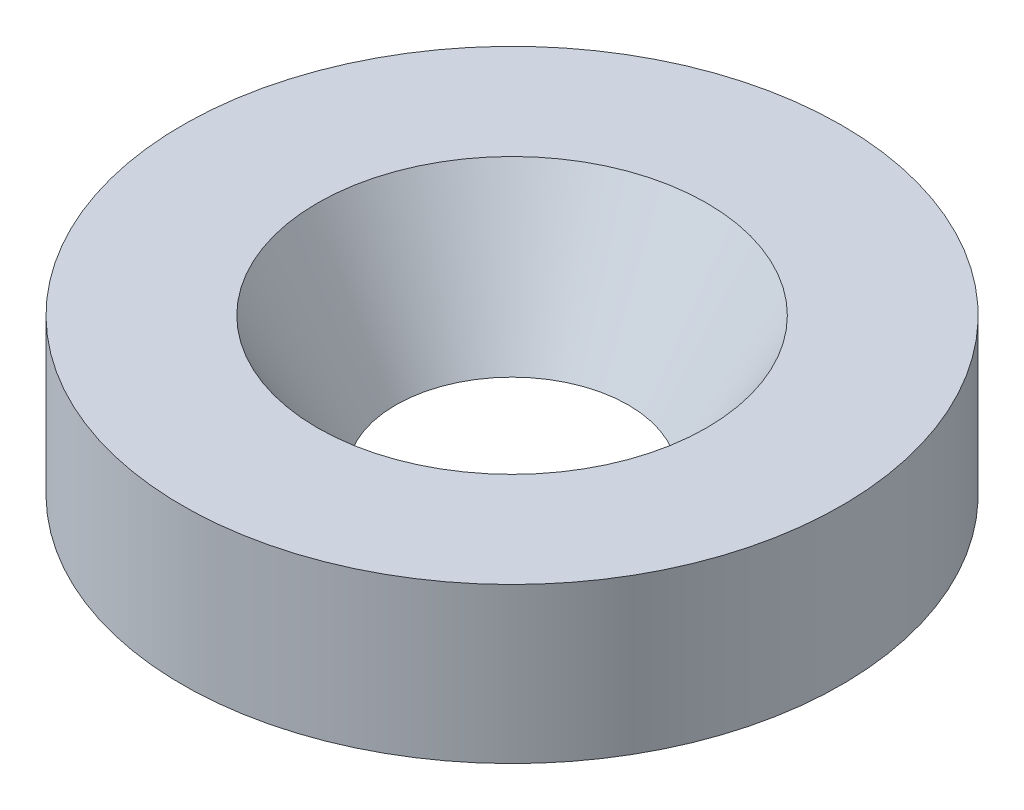
ISO-10303-21;
HEADER;
FILE_DESCRIPTION(('STEP AP214'),'2;1');
FILE_NAME('part.step','',(''),(''),'','','');
FILE_SCHEMA(('AUTOMOTIVE_DESIGN { 1 0 10303 214 1 1 1 1 }'));
ENDSEC;
DATA;
#1=APPLICATION_CONTEXT('core data for automotive mechanical design processes');
#2=APPLICATION_PROTOCOL_DEFINITION('international standard','automotive_design',2000,#1);
#3=PRODUCT_CONTEXT('',#1,'mechanical');
#4=PRODUCT('Part','Part','',(#3));
#5=PRODUCT_RELATED_PRODUCT_CATEGORY('part','',(#4));
#6=PRODUCT_DEFINITION_FORMATION('','',#4);
#7=PRODUCT_DEFINITION_CONTEXT('part definition',#1,'design');
#8=PRODUCT_DEFINITION('design','',#6,#7);
#9=PRODUCT_DEFINITION_SHAPE('','',#8);
#10=(LENGTH_UNIT() NAMED_UNIT(*) SI_UNIT(.MILLI.,.METRE.));
#11=(NAMED_UNIT(*) PLANE_ANGLE_UNIT() SI_UNIT($,.RADIAN.));
#12=(NAMED_UNIT(*) SI_UNIT($,.STERADIAN.) SOLID_ANGLE_UNIT());
#13=UNCERTAINTY_MEASURE_WITH_UNIT(LENGTH_MEASURE(1.E-05),#10,'distance_accuracy_value','');
#14=(GEOMETRIC_REPRESENTATION_CONTEXT(3) GLOBAL_UNCERTAINTY_ASSIGNED_CONTEXT((#13)) GLOBAL_UNIT_ASSIGNED_CONTEXT((#10,
#11,#12)) REPRESENTATION_CONTEXT('',''));
#15=CARTESIAN_POINT('',(0.,0.,0.));
#16=DIRECTION('',(0.,0.,1.));
#17=DIRECTION('',(1.,0.,0.));
#18=AXIS2_PLACEMENT_3D('',#15,#16,#17);
#19=CARTESIAN_POINT('',(0.,0.,0.));
#20=DIRECTION('',(0.,-1.,0.));
#21=DIRECTION('',(0.,0.,-1.));
#22=AXIS2_PLACEMENT_3D('',#19,#20,#21);
#23=CYLINDRICAL_SURFACE('',#22,8.);
#24=CARTESIAN_POINT('',(0.,0.,0.));
#25=DIRECTION('',(0.,-1.,0.));
#26=DIRECTION('',(0.,0.,-1.));
#27=AXIS2_PLACEMENT_3D('',#24,#25,#26);
#28=CIRCLE('',#27,8.);
#29=CARTESIAN_POINT('',(0.,0.,-8.));
#30=VERTEX_POINT('',#29);
#31=EDGE_CURVE('E10',#30,#30,#28,.T.);
#32=ORIENTED_EDGE('',*,*,#31,.T.);
#33=EDGE_LOOP('',(#32));
#34=FACE_BOUND('',#33,.T.);
#35=CARTESIAN_POINT('',(0.,2.75,0.));
#36=DIRECTION('',(0.,-1.,0.));
#37=DIRECTION('',(0.,0.,-1.));
#38=AXIS2_PLACEMENT_3D('',#35,#36,#37);
#39=CIRCLE('',#38,8.);
#40=CARTESIAN_POINT('',(0.,2.75,-8.));
#41=VERTEX_POINT('',#40);
#42=EDGE_CURVE('E76',#41,#41,#39,.T.);
#43=ORIENTED_EDGE('',*,*,#42,.F.);
#44=EDGE_LOOP('',(#43));
#45=FACE_BOUND('',#44,.T.);
#46=ADVANCED_FACE('F41',(#34,#45),#23,.F.);
#47=CARTESIAN_POINT('',(0.,0.,-8.));
#48=DIRECTION('',(0.,-1.,0.));
#49=DIRECTION('',(0.,0.,-1.));
#50=AXIS2_PLACEMENT_3D('',#47,#48,#49);
#51=PLANE('',#50);
#52=CARTESIAN_POINT('',(0.,0.,0.));
#53=DIRECTION('',(0.,-1.,0.));
#54=DIRECTION('',(0.,0.,-1.));
#55=AXIS2_PLACEMENT_3D('',#52,#53,#54);
#56=CIRCLE('',#55,8.5);
#57=CARTESIAN_POINT('',(0.,0.,-8.5));
#58=VERTEX_POINT('',#57);
#59=EDGE_CURVE('E48',#58,#58,#56,.T.);
#60=ORIENTED_EDGE('',*,*,#59,.T.);
#61=EDGE_LOOP('',(#60));
#62=FACE_BOUND('',#61,.T.);
#63=ORIENTED_EDGE('',*,*,#31,.F.);
#64=EDGE_LOOP('',(#63));
#65=FACE_BOUND('',#64,.T.);
#66=ADVANCED_FACE('F85',(#62,#65),#51,.T.);
#67=CARTESIAN_POINT('',(0.,0.,0.));
#68=DIRECTION('',(0.,-1.,0.));
#69=DIRECTION('',(0.,0.,-1.));
#70=AXIS2_PLACEMENT_3D('',#67,#68,#69);
#71=CYLINDRICAL_SURFACE('',#70,8.5);
#72=CARTESIAN_POINT('',(0.,4.,0.));
#73=DIRECTION('',(0.,-1.,0.));
#74=DIRECTION('',(0.,0.,-1.));
#75=AXIS2_PLACEMENT_3D('',#72,#73,#74);
#76=CIRCLE('',#75,8.5);
#77=CARTESIAN_POINT('',(0.,4.,-8.5));
#78=VERTEX_POINT('',#77);
#79=EDGE_CURVE('E53',#78,#78,#76,.T.);
#80=ORIENTED_EDGE('',*,*,#79,.T.);
#81=EDGE_LOOP('',(#80));
#82=FACE_BOUND('',#81,.T.);
#83=ORIENTED_EDGE('',*,*,#59,.F.);
#84=EDGE_LOOP('',(#83));
#85=FACE_BOUND('',#84,.T.);
#86=ADVANCED_FACE('F89',(#82,#85),#71,.T.);
#87=CARTESIAN_POINT('',(0.,4.,-8.5));
#88=DIRECTION('',(0.,1.,0.));
#89=DIRECTION('',(0.,0.,1.));
#90=AXIS2_PLACEMENT_3D('',#87,#88,#89);
#91=PLANE('',#90);
#92=CARTESIAN_POINT('',(0.,4.,0.));
#93=DIRECTION('',(0.,-1.,0.));
#94=DIRECTION('',(0.,0.,-1.));
#95=AXIS2_PLACEMENT_3D('',#92,#93,#94);
#96=CIRCLE('',#95,5.02072594216371);
#97=CARTESIAN_POINT('',(0.,4.,-5.02072594216371));
#98=VERTEX_POINT('',#97);
#99=EDGE_CURVE('E58',#98,#98,#96,.T.);
#100=ORIENTED_EDGE('',*,*,#99,.T.);
#101=EDGE_LOOP('',(#100));
#102=FACE_BOUND('',#101,.T.);
#103=ORIENTED_EDGE('',*,*,#79,.F.);
#104=EDGE_LOOP('',(#103));
#105=FACE_BOUND('',#104,.T.);
#106=ADVANCED_FACE('F93',(#102,#105),#91,.T.);
#107=CARTESIAN_POINT('',(0.,4.,0.));
#108=DIRECTION('',(0.,1.,0.));
#109=DIRECTION('',(0.,0.,1.));
#110=AXIS2_PLACEMENT_3D('',#107,#108,#109);
#111=CONICAL_SURFACE('',#110,5.02072594216371,0.523598775598303);
#112=CARTESIAN_POINT('',(0.,0.499999999999999,0.));
#113=DIRECTION('',(0.,-1.,0.));
#114=DIRECTION('',(0.,0.,-1.));
#115=AXIS2_PLACEMENT_3D('',#112,#113,#114);
#116=CIRCLE('',#115,3.);
#117=CARTESIAN_POINT('',(0.,0.499999999999999,-3.));
#118=VERTEX_POINT('',#117);
#119=EDGE_CURVE('E64',#118,#118,#116,.T.);
#120=ORIENTED_EDGE('',*,*,#119,.T.);
#121=EDGE_LOOP('',(#120));
#122=FACE_BOUND('',#121,.T.);
#123=ORIENTED_EDGE('',*,*,#99,.F.);
#124=EDGE_LOOP('',(#123));
#125=FACE_BOUND('',#124,.T.);
#126=ADVANCED_FACE('F100',(#122,#125),#111,.F.);
#127=CARTESIAN_POINT('',(0.,0.499999999999999,-3.));
#128=DIRECTION('',(0.,-1.,0.));
#129=DIRECTION('',(0.,0.,-1.));
#130=AXIS2_PLACEMENT_3D('',#127,#128,#129);
#131=PLANE('',#130);
#132=CARTESIAN_POINT('',(0.,0.499999999999999,0.));
#133=DIRECTION('',(0.,-1.,0.));
#134=DIRECTION('',(0.,0.,-1.));
#135=AXIS2_PLACEMENT_3D('',#132,#133,#134);
#136=CIRCLE('',#135,6.);
#137=CARTESIAN_POINT('',(0.,0.499999999999999,-6.));
#138=VERTEX_POINT('',#137);
#139=EDGE_CURVE('E68',#138,#138,#136,.T.);
#140=ORIENTED_EDGE('',*,*,#139,.T.);
#141=EDGE_LOOP('',(#140));
#142=FACE_BOUND('',#141,.T.);
#143=ORIENTED_EDGE('',*,*,#119,.F.);
#144=EDGE_LOOP('',(#143));
#145=FACE_BOUND('',#144,.T.);
#146=ADVANCED_FACE('F104',(#142,#145),#131,.T.);
#147=CARTESIAN_POINT('',(0.,0.,0.));
#148=DIRECTION('',(0.,-1.,0.));
#149=DIRECTION('',(0.,0.,-1.));
#150=AXIS2_PLACEMENT_3D('',#147,#148,#149);
#151=CYLINDRICAL_SURFACE('',#150,6.);
#152=CARTESIAN_POINT('',(0.,2.75,0.));
#153=DIRECTION('',(0.,-1.,0.));
#154=DIRECTION('',(0.,0.,-1.));
#155=AXIS2_PLACEMENT_3D('',#152,#153,#154);
#156=CIRCLE('',#155,6.);
#157=CARTESIAN_POINT('',(0.,2.75,-6.));
#158=VERTEX_POINT('',#157);
#159=EDGE_CURVE('E72',#158,#158,#156,.T.);
#160=ORIENTED_EDGE('',*,*,#159,.T.);
#161=EDGE_LOOP('',(#160));
#162=FACE_BOUND('',#161,.T.);
#163=ORIENTED_EDGE('',*,*,#139,.F.);
#164=EDGE_LOOP('',(#163));
#165=FACE_BOUND('',#164,.T.);
#166=ADVANCED_FACE('F108',(#162,#165),#151,.T.);
#167=CARTESIAN_POINT('',(0.,2.75,-6.));
#168=DIRECTION('',(0.,-1.,0.));
#169=DIRECTION('',(0.,0.,-1.));
#170=AXIS2_PLACEMENT_3D('',#167,#168,#169);
#171=PLANE('',#170);
#172=ORIENTED_EDGE('',*,*,#42,.T.);
#173=EDGE_LOOP('',(#172));
#174=FACE_BOUND('',#173,.T.);
#175=ORIENTED_EDGE('',*,*,#159,.F.);
#176=EDGE_LOOP('',(#175));
#177=FACE_BOUND('',#176,.T.);
#178=ADVANCED_FACE('F81',(#174,#177),#171,.T.);
#179=CLOSED_SHELL('',(#46,#66,#86,#106,#126,#146,#166,#178));
#180=MANIFOLD_SOLID_BREP('B2',#179);
#181=ADVANCED_BREP_SHAPE_REPRESENTATION('',(#18,#180),#14);
#182=SHAPE_DEFINITION_REPRESENTATION(#9,#181);
ENDSEC;
END-ISO-10303-21;
